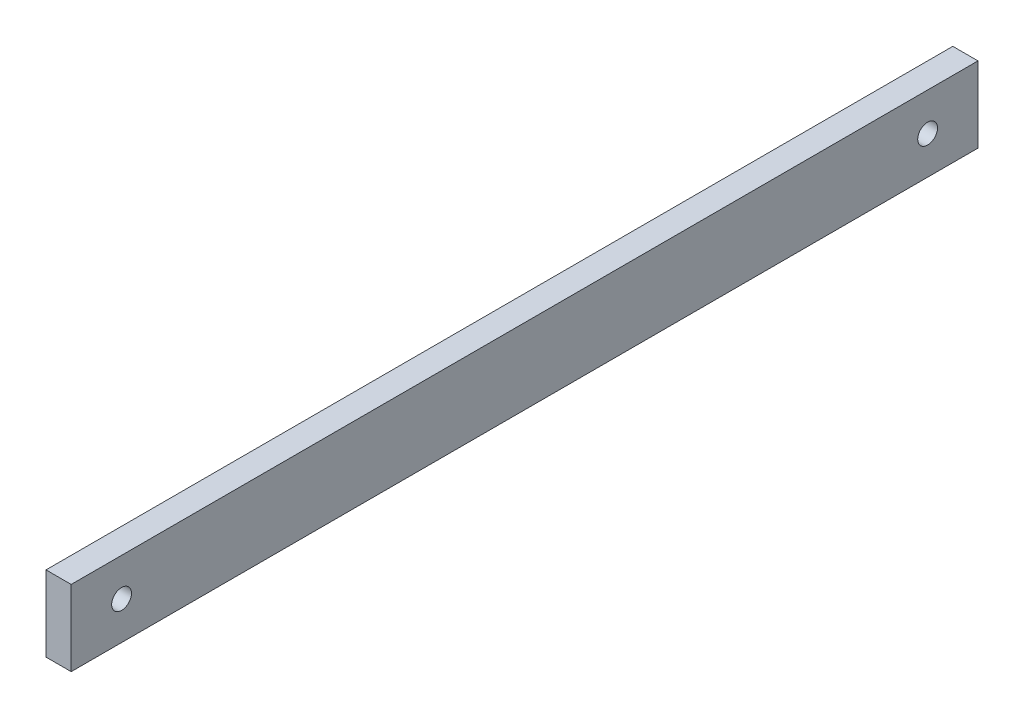
ISO-10303-21;
HEADER;
FILE_DESCRIPTION(('STEP AP214'),'2;1');
FILE_NAME('part.step','',(''),(''),'','','');
FILE_SCHEMA(('AUTOMOTIVE_DESIGN { 1 0 10303 214 1 1 1 1 }'));
ENDSEC;
DATA;
#1=APPLICATION_CONTEXT('core data for automotive mechanical design processes');
#2=APPLICATION_PROTOCOL_DEFINITION('international standard','automotive_design',2000,#1);
#3=PRODUCT_CONTEXT('',#1,'mechanical');
#4=PRODUCT('Part','Part','',(#3));
#5=PRODUCT_RELATED_PRODUCT_CATEGORY('part','',(#4));
#6=PRODUCT_DEFINITION_FORMATION('','',#4);
#7=PRODUCT_DEFINITION_CONTEXT('part definition',#1,'design');
#8=PRODUCT_DEFINITION('design','',#6,#7);
#9=PRODUCT_DEFINITION_SHAPE('','',#8);
#10=(LENGTH_UNIT() NAMED_UNIT(*) SI_UNIT(.MILLI.,.METRE.));
#11=(NAMED_UNIT(*) PLANE_ANGLE_UNIT() SI_UNIT($,.RADIAN.));
#12=(NAMED_UNIT(*) SI_UNIT($,.STERADIAN.) SOLID_ANGLE_UNIT());
#13=UNCERTAINTY_MEASURE_WITH_UNIT(LENGTH_MEASURE(1.E-05),#10,'distance_accuracy_value','');
#14=(GEOMETRIC_REPRESENTATION_CONTEXT(3) GLOBAL_UNCERTAINTY_ASSIGNED_CONTEXT((#13)) GLOBAL_UNIT_ASSIGNED_CONTEXT((#10,
#11,#12)) REPRESENTATION_CONTEXT('',''));
#15=CARTESIAN_POINT('',(0.,0.,0.));
#16=DIRECTION('',(0.,0.,1.));
#17=DIRECTION('',(1.,0.,0.));
#18=AXIS2_PLACEMENT_3D('',#15,#16,#17);
#19=CARTESIAN_POINT('',(3.175,9.525,114.3));
#20=DIRECTION('',(-1.,0.,0.));
#21=DIRECTION('',(0.,-1.,0.));
#22=AXIS2_PLACEMENT_3D('',#19,#20,#21);
#23=PLANE('',#22);
#24=CARTESIAN_POINT('',(3.175,0.,101.6));
#25=DIRECTION('',(1.,0.,0.));
#26=DIRECTION('',(0.,0.,-1.));
#27=AXIS2_PLACEMENT_3D('',#24,#25,#26);
#28=CIRCLE('',#27,2.49999999999999);
#29=CARTESIAN_POINT('',(3.175,0.,99.1));
#30=VERTEX_POINT('',#29);
#31=EDGE_CURVE('E123',#30,#30,#28,.T.);
#32=ORIENTED_EDGE('',*,*,#31,.F.);
#33=EDGE_LOOP('',(#32));
#34=FACE_BOUND('',#33,.T.);
#35=CARTESIAN_POINT('',(3.175,0.,-101.6));
#36=DIRECTION('',(1.,0.,0.));
#37=DIRECTION('',(0.,0.,-1.));
#38=AXIS2_PLACEMENT_3D('',#35,#36,#37);
#39=CIRCLE('',#38,2.49999999999999);
#40=CARTESIAN_POINT('',(3.175,0.,-104.1));
#41=VERTEX_POINT('',#40);
#42=EDGE_CURVE('E117',#41,#41,#39,.T.);
#43=ORIENTED_EDGE('',*,*,#42,.F.);
#44=EDGE_LOOP('',(#43));
#45=FACE_BOUND('',#44,.T.);
#46=DIRECTION('',(0.,1.,0.));
#47=VECTOR('',#46,1.);
#48=CARTESIAN_POINT('',(3.175,9.525,-114.3));
#49=LINE('',#48,#47);
#50=CARTESIAN_POINT('',(3.175,-9.525,-114.3));
#51=VERTEX_POINT('',#50);
#52=CARTESIAN_POINT('',(3.175,9.525,-114.3));
#53=VERTEX_POINT('',#52);
#54=EDGE_CURVE('E101',#51,#53,#49,.T.);
#55=ORIENTED_EDGE('',*,*,#54,.T.);
#56=DIRECTION('',(0.,0.,-1.));
#57=VECTOR('',#56,1.);
#58=CARTESIAN_POINT('',(3.175,9.525,114.3));
#59=LINE('',#58,#57);
#60=CARTESIAN_POINT('',(3.175,9.525,114.3));
#61=VERTEX_POINT('',#60);
#62=EDGE_CURVE('E11',#61,#53,#59,.T.);
#63=ORIENTED_EDGE('',*,*,#62,.F.);
#64=DIRECTION('',(0.,1.,0.));
#65=VECTOR('',#64,1.);
#66=CARTESIAN_POINT('',(3.175,9.525,114.3));
#67=LINE('',#66,#65);
#68=CARTESIAN_POINT('',(3.175,-9.525,114.3));
#69=VERTEX_POINT('',#68);
#70=EDGE_CURVE('E89',#69,#61,#67,.T.);
#71=ORIENTED_EDGE('',*,*,#70,.F.);
#72=DIRECTION('',(0.,0.,-1.));
#73=VECTOR('',#72,1.);
#74=CARTESIAN_POINT('',(3.175,-9.525,114.3));
#75=LINE('',#74,#73);
#76=EDGE_CURVE('E97',#69,#51,#75,.T.);
#77=ORIENTED_EDGE('',*,*,#76,.T.);
#78=EDGE_LOOP('',(#55,#63,#71,#77));
#79=FACE_BOUND('',#78,.T.);
#80=ADVANCED_FACE('F38',(#34,#45,#79),#23,.F.);
#81=CARTESIAN_POINT('',(-3.175,9.525,114.3));
#82=DIRECTION('',(0.,-1.,0.));
#83=DIRECTION('',(0.,0.,-1.));
#84=AXIS2_PLACEMENT_3D('',#81,#82,#83);
#85=PLANE('',#84);
#86=DIRECTION('',(-1.,0.,0.));
#87=VECTOR('',#86,1.);
#88=CARTESIAN_POINT('',(-3.175,9.525,-114.3));
#89=LINE('',#88,#87);
#90=CARTESIAN_POINT('',(-3.175,9.525,-114.3));
#91=VERTEX_POINT('',#90);
#92=EDGE_CURVE('E93',#53,#91,#89,.T.);
#93=ORIENTED_EDGE('',*,*,#92,.T.);
#94=DIRECTION('',(0.,0.,-1.));
#95=VECTOR('',#94,1.);
#96=CARTESIAN_POINT('',(-3.175,9.525,114.3));
#97=LINE('',#96,#95);
#98=CARTESIAN_POINT('',(-3.175,9.525,114.3));
#99=VERTEX_POINT('',#98);
#100=EDGE_CURVE('E46',#99,#91,#97,.T.);
#101=ORIENTED_EDGE('',*,*,#100,.F.);
#102=DIRECTION('',(-1.,0.,0.));
#103=VECTOR('',#102,1.);
#104=CARTESIAN_POINT('',(-3.175,9.525,114.3));
#105=LINE('',#104,#103);
#106=EDGE_CURVE('E84',#61,#99,#105,.T.);
#107=ORIENTED_EDGE('',*,*,#106,.F.);
#108=ORIENTED_EDGE('',*,*,#62,.T.);
#109=EDGE_LOOP('',(#93,#101,#107,#108));
#110=FACE_BOUND('',#109,.T.);
#111=ADVANCED_FACE('F92',(#110),#85,.F.);
#112=CARTESIAN_POINT('',(-3.175,9.525,114.3));
#113=DIRECTION('',(1.,0.,0.));
#114=DIRECTION('',(0.,1.,0.));
#115=AXIS2_PLACEMENT_3D('',#112,#113,#114);
#116=PLANE('',#115);
#117=CARTESIAN_POINT('',(-3.175,0.,101.6));
#118=DIRECTION('',(1.,0.,0.));
#119=DIRECTION('',(0.,1.,0.));
#120=AXIS2_PLACEMENT_3D('',#117,#118,#119);
#121=CIRCLE('',#120,2.49999999999999);
#122=CARTESIAN_POINT('',(-3.175,2.49999999999999,101.6));
#123=VERTEX_POINT('',#122);
#124=EDGE_CURVE('E120',#123,#123,#121,.T.);
#125=ORIENTED_EDGE('',*,*,#124,.T.);
#126=EDGE_LOOP('',(#125));
#127=FACE_BOUND('',#126,.T.);
#128=CARTESIAN_POINT('',(-3.175,0.,-101.6));
#129=DIRECTION('',(1.,0.,0.));
#130=DIRECTION('',(0.,1.,0.));
#131=AXIS2_PLACEMENT_3D('',#128,#129,#130);
#132=CIRCLE('',#131,2.49999999999999);
#133=CARTESIAN_POINT('',(-3.175,2.49999999999999,-101.6));
#134=VERTEX_POINT('',#133);
#135=EDGE_CURVE('E104',#134,#134,#132,.T.);
#136=ORIENTED_EDGE('',*,*,#135,.T.);
#137=EDGE_LOOP('',(#136));
#138=FACE_BOUND('',#137,.T.);
#139=DIRECTION('',(0.,-1.,0.));
#140=VECTOR('',#139,1.);
#141=CARTESIAN_POINT('',(-3.175,9.525,-114.3));
#142=LINE('',#141,#140);
#143=CARTESIAN_POINT('',(-3.175,-9.525,-114.3));
#144=VERTEX_POINT('',#143);
#145=EDGE_CURVE('E71',#91,#144,#142,.T.);
#146=ORIENTED_EDGE('',*,*,#145,.T.);
#147=DIRECTION('',(0.,0.,-1.));
#148=VECTOR('',#147,1.);
#149=CARTESIAN_POINT('',(-3.175,-9.525,114.3));
#150=LINE('',#149,#148);
#151=CARTESIAN_POINT('',(-3.175,-9.525,114.3));
#152=VERTEX_POINT('',#151);
#153=EDGE_CURVE('E94',#152,#144,#150,.T.);
#154=ORIENTED_EDGE('',*,*,#153,.F.);
#155=DIRECTION('',(0.,-1.,0.));
#156=VECTOR('',#155,1.);
#157=CARTESIAN_POINT('',(-3.175,9.525,114.3));
#158=LINE('',#157,#156);
#159=EDGE_CURVE('E87',#99,#152,#158,.T.);
#160=ORIENTED_EDGE('',*,*,#159,.F.);
#161=ORIENTED_EDGE('',*,*,#100,.T.);
#162=EDGE_LOOP('',(#146,#154,#160,#161));
#163=FACE_BOUND('',#162,.T.);
#164=ADVANCED_FACE('F95',(#127,#138,#163),#116,.F.);
#165=CARTESIAN_POINT('',(-3.175,-9.525,114.3));
#166=DIRECTION('',(0.,1.,0.));
#167=DIRECTION('',(0.,0.,1.));
#168=AXIS2_PLACEMENT_3D('',#165,#166,#167);
#169=PLANE('',#168);
#170=DIRECTION('',(1.,0.,0.));
#171=VECTOR('',#170,1.);
#172=CARTESIAN_POINT('',(-3.175,-9.525,-114.3));
#173=LINE('',#172,#171);
#174=EDGE_CURVE('E77',#144,#51,#173,.T.);
#175=ORIENTED_EDGE('',*,*,#174,.T.);
#176=ORIENTED_EDGE('',*,*,#76,.F.);
#177=DIRECTION('',(1.,0.,0.));
#178=VECTOR('',#177,1.);
#179=CARTESIAN_POINT('',(-3.175,-9.525,114.3));
#180=LINE('',#179,#178);
#181=EDGE_CURVE('E54',#152,#69,#180,.T.);
#182=ORIENTED_EDGE('',*,*,#181,.F.);
#183=ORIENTED_EDGE('',*,*,#153,.T.);
#184=EDGE_LOOP('',(#175,#176,#182,#183));
#185=FACE_BOUND('',#184,.T.);
#186=ADVANCED_FACE('F109',(#185),#169,.F.);
#187=CARTESIAN_POINT('',(3.175,-9.525,114.3));
#188=DIRECTION('',(0.,0.,1.));
#189=DIRECTION('',(1.,0.,0.));
#190=AXIS2_PLACEMENT_3D('',#187,#188,#189);
#191=PLANE('',#190);
#192=ORIENTED_EDGE('',*,*,#70,.T.);
#193=ORIENTED_EDGE('',*,*,#106,.T.);
#194=ORIENTED_EDGE('',*,*,#159,.T.);
#195=ORIENTED_EDGE('',*,*,#181,.T.);
#196=EDGE_LOOP('',(#192,#193,#194,#195));
#197=FACE_BOUND('',#196,.T.);
#198=ADVANCED_FACE('F85',(#197),#191,.T.);
#199=CARTESIAN_POINT('',(3.175,-9.525,-114.3));
#200=DIRECTION('',(0.,0.,1.));
#201=DIRECTION('',(1.,0.,0.));
#202=AXIS2_PLACEMENT_3D('',#199,#200,#201);
#203=PLANE('',#202);
#204=ORIENTED_EDGE('',*,*,#54,.F.);
#205=ORIENTED_EDGE('',*,*,#174,.F.);
#206=ORIENTED_EDGE('',*,*,#145,.F.);
#207=ORIENTED_EDGE('',*,*,#92,.F.);
#208=EDGE_LOOP('',(#204,#205,#206,#207));
#209=FACE_BOUND('',#208,.T.);
#210=ADVANCED_FACE('F112',(#209),#203,.F.);
#211=CARTESIAN_POINT('',(3.175,0.,-101.6));
#212=DIRECTION('',(1.,0.,0.));
#213=DIRECTION('',(0.,0.,-1.));
#214=AXIS2_PLACEMENT_3D('',#211,#212,#213);
#215=CYLINDRICAL_SURFACE('',#214,2.49999999999999);
#216=ORIENTED_EDGE('',*,*,#135,.F.);
#217=EDGE_LOOP('',(#216));
#218=FACE_BOUND('',#217,.T.);
#219=ORIENTED_EDGE('',*,*,#42,.T.);
#220=EDGE_LOOP('',(#219));
#221=FACE_BOUND('',#220,.T.);
#222=ADVANCED_FACE('F133',(#218,#221),#215,.F.);
#223=CARTESIAN_POINT('',(3.175,0.,101.6));
#224=DIRECTION('',(1.,0.,0.));
#225=DIRECTION('',(0.,0.,-1.));
#226=AXIS2_PLACEMENT_3D('',#223,#224,#225);
#227=CYLINDRICAL_SURFACE('',#226,2.49999999999999);
#228=ORIENTED_EDGE('',*,*,#124,.F.);
#229=EDGE_LOOP('',(#228));
#230=FACE_BOUND('',#229,.T.);
#231=ORIENTED_EDGE('',*,*,#31,.T.);
#232=EDGE_LOOP('',(#231));
#233=FACE_BOUND('',#232,.T.);
#234=ADVANCED_FACE('F127',(#230,#233),#227,.F.);
#235=CLOSED_SHELL('',(#80,#111,#164,#186,#198,#210,#222,#234));
#236=MANIFOLD_SOLID_BREP('B2',#235);
#237=ADVANCED_BREP_SHAPE_REPRESENTATION('',(#18,#236),#14);
#238=SHAPE_DEFINITION_REPRESENTATION(#9,#237);
ENDSEC;
END-ISO-10303-21;
